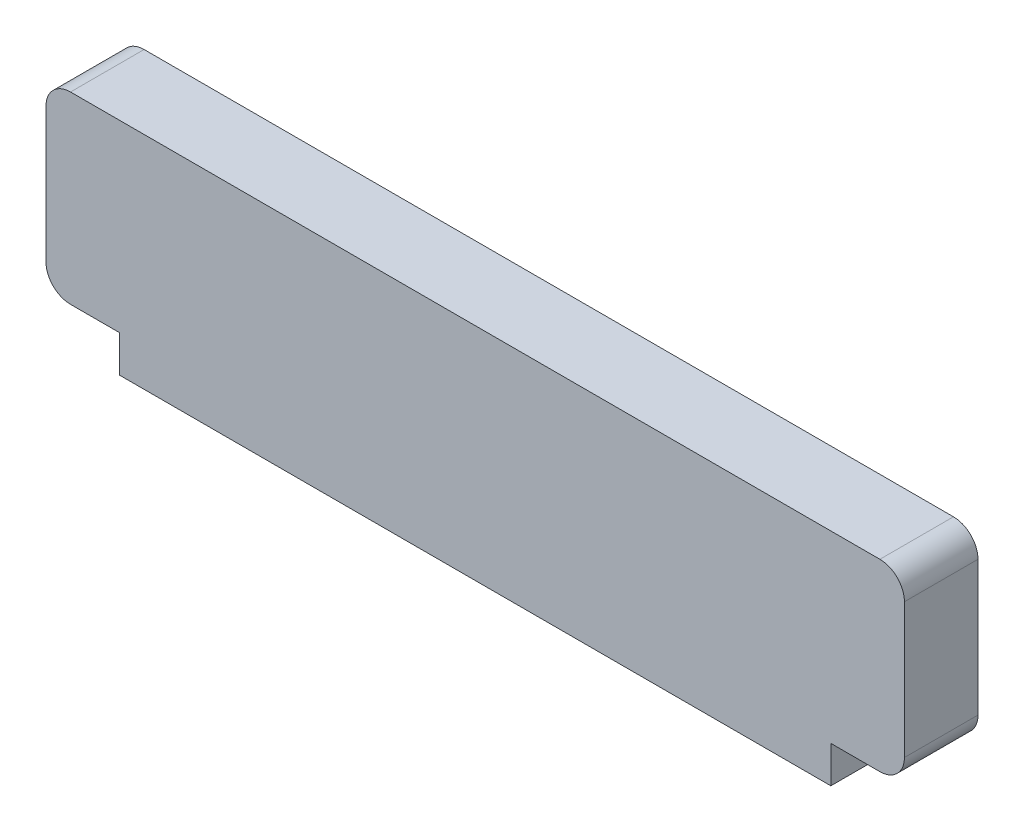
ISO-10303-21;
HEADER;
FILE_DESCRIPTION(('STEP AP214'),'2;1');
FILE_NAME('part.step','',(''),(''),'','','');
FILE_SCHEMA(('AUTOMOTIVE_DESIGN { 1 0 10303 214 1 1 1 1 }'));
ENDSEC;
DATA;
#1=APPLICATION_CONTEXT('core data for automotive mechanical design processes');
#2=APPLICATION_PROTOCOL_DEFINITION('international standard','automotive_design',2000,#1);
#3=PRODUCT_CONTEXT('',#1,'mechanical');
#4=PRODUCT('Part','Part','',(#3));
#5=PRODUCT_RELATED_PRODUCT_CATEGORY('part','',(#4));
#6=PRODUCT_DEFINITION_FORMATION('','',#4);
#7=PRODUCT_DEFINITION_CONTEXT('part definition',#1,'design');
#8=PRODUCT_DEFINITION('design','',#6,#7);
#9=PRODUCT_DEFINITION_SHAPE('','',#8);
#10=(LENGTH_UNIT() NAMED_UNIT(*) SI_UNIT(.MILLI.,.METRE.));
#11=(NAMED_UNIT(*) PLANE_ANGLE_UNIT() SI_UNIT($,.RADIAN.));
#12=(NAMED_UNIT(*) SI_UNIT($,.STERADIAN.) SOLID_ANGLE_UNIT());
#13=UNCERTAINTY_MEASURE_WITH_UNIT(LENGTH_MEASURE(1.E-05),#10,'distance_accuracy_value','');
#14=(GEOMETRIC_REPRESENTATION_CONTEXT(3) GLOBAL_UNCERTAINTY_ASSIGNED_CONTEXT((#13)) GLOBAL_UNIT_ASSIGNED_CONTEXT((#10,
#11,#12)) REPRESENTATION_CONTEXT('',''));
#15=CARTESIAN_POINT('',(0.,0.,0.));
#16=DIRECTION('',(0.,0.,1.));
#17=DIRECTION('',(1.,0.,0.));
#18=AXIS2_PLACEMENT_3D('',#15,#16,#17);
#19=CARTESIAN_POINT('',(0.,0.,6.));
#20=DIRECTION('',(0.,1.,0.));
#21=DIRECTION('',(0.,0.,1.));
#22=AXIS2_PLACEMENT_3D('',#19,#20,#21);
#23=PLANE('',#22);
#24=DIRECTION('',(0.,0.,-1.));
#25=VECTOR('',#24,1.);
#26=CARTESIAN_POINT('',(6.,0.,6.));
#27=LINE('',#26,#25);
#28=CARTESIAN_POINT('',(6.,0.,6.));
#29=VERTEX_POINT('',#28);
#30=CARTESIAN_POINT('',(6.,0.,0.));
#31=VERTEX_POINT('',#30);
#32=EDGE_CURVE('E57',#29,#31,#27,.T.);
#33=ORIENTED_EDGE('',*,*,#32,.F.);
#34=DIRECTION('',(1.,0.,0.));
#35=VECTOR('',#34,1.);
#36=CARTESIAN_POINT('',(0.,0.,6.));
#37=LINE('',#36,#35);
#38=CARTESIAN_POINT('',(2.,0.,6.));
#39=VERTEX_POINT('',#38);
#40=EDGE_CURVE('E162',#39,#29,#37,.T.);
#41=ORIENTED_EDGE('',*,*,#40,.F.);
#42=DIRECTION('',(0.,0.,-1.));
#43=VECTOR('',#42,1.);
#44=CARTESIAN_POINT('',(2.,0.,6.));
#45=LINE('',#44,#43);
#46=CARTESIAN_POINT('',(2.,0.,0.));
#47=VERTEX_POINT('',#46);
#48=EDGE_CURVE('E206',#39,#47,#45,.T.);
#49=ORIENTED_EDGE('',*,*,#48,.T.);
#50=DIRECTION('',(1.,0.,0.));
#51=VECTOR('',#50,1.);
#52=CARTESIAN_POINT('',(0.,0.,0.));
#53=LINE('',#52,#51);
#54=EDGE_CURVE('E171',#47,#31,#53,.T.);
#55=ORIENTED_EDGE('',*,*,#54,.T.);
#56=EDGE_LOOP('',(#33,#41,#49,#55));
#57=FACE_BOUND('',#56,.T.);
#58=ADVANCED_FACE('F34',(#57),#23,.F.);
#59=DIRECTION('',(0.,0.,1.));
#60=VECTOR('',#59,1.);
#61=CARTESIAN_POINT('',(64.,0.,6.));
#62=LINE('',#61,#60);
#63=CARTESIAN_POINT('',(64.,0.,0.));
#64=VERTEX_POINT('',#63);
#65=CARTESIAN_POINT('',(64.,0.,6.));
#66=VERTEX_POINT('',#65);
#67=EDGE_CURVE('E146',#64,#66,#62,.T.);
#68=ORIENTED_EDGE('',*,*,#67,.F.);
#69=CARTESIAN_POINT('',(68.,0.,0.));
#70=VERTEX_POINT('',#69);
#71=EDGE_CURVE('E152',#64,#70,#53,.T.);
#72=ORIENTED_EDGE('',*,*,#71,.T.);
#73=DIRECTION('',(0.,0.,-1.));
#74=VECTOR('',#73,1.);
#75=CARTESIAN_POINT('',(68.,0.,6.));
#76=LINE('',#75,#74);
#77=CARTESIAN_POINT('',(68.,0.,6.));
#78=VERTEX_POINT('',#77);
#79=EDGE_CURVE('E204',#70,#78,#76,.F.);
#80=ORIENTED_EDGE('',*,*,#79,.T.);
#81=EDGE_CURVE('E49',#66,#78,#37,.T.);
#82=ORIENTED_EDGE('',*,*,#81,.F.);
#83=EDGE_LOOP('',(#68,#72,#80,#82));
#84=FACE_BOUND('',#83,.T.);
#85=ADVANCED_FACE('F248',(#84),#23,.F.);
#86=CARTESIAN_POINT('',(0.,0.,6.));
#87=DIRECTION('',(1.,0.,0.));
#88=DIRECTION('',(0.,0.,-1.));
#89=AXIS2_PLACEMENT_3D('',#86,#87,#88);
#90=PLANE('',#89);
#91=DIRECTION('',(0.,-1.,0.));
#92=VECTOR('',#91,1.);
#93=CARTESIAN_POINT('',(0.,0.,6.));
#94=LINE('',#93,#92);
#95=CARTESIAN_POINT('',(0.,13.,6.));
#96=VERTEX_POINT('',#95);
#97=CARTESIAN_POINT('',(0.,2.,6.));
#98=VERTEX_POINT('',#97);
#99=EDGE_CURVE('E158',#96,#98,#94,.T.);
#100=ORIENTED_EDGE('',*,*,#99,.F.);
#101=DIRECTION('',(0.,0.,-1.));
#102=VECTOR('',#101,1.);
#103=CARTESIAN_POINT('',(0.,13.,6.));
#104=LINE('',#103,#102);
#105=CARTESIAN_POINT('',(0.,13.,0.));
#106=VERTEX_POINT('',#105);
#107=EDGE_CURVE('E179',#96,#106,#104,.T.);
#108=ORIENTED_EDGE('',*,*,#107,.T.);
#109=DIRECTION('',(0.,-1.,0.));
#110=VECTOR('',#109,1.);
#111=CARTESIAN_POINT('',(0.,0.,0.));
#112=LINE('',#111,#110);
#113=CARTESIAN_POINT('',(0.,2.,0.));
#114=VERTEX_POINT('',#113);
#115=EDGE_CURVE('E149',#106,#114,#112,.T.);
#116=ORIENTED_EDGE('',*,*,#115,.T.);
#117=DIRECTION('',(0.,0.,-1.));
#118=VECTOR('',#117,1.);
#119=CARTESIAN_POINT('',(0.,2.,6.));
#120=LINE('',#119,#118);
#121=EDGE_CURVE('E169',#114,#98,#120,.F.);
#122=ORIENTED_EDGE('',*,*,#121,.T.);
#123=EDGE_LOOP('',(#100,#108,#116,#122));
#124=FACE_BOUND('',#123,.T.);
#125=ADVANCED_FACE('F231',(#124),#90,.F.);
#126=CARTESIAN_POINT('',(70.,0.,6.));
#127=DIRECTION('',(-1.,0.,0.));
#128=DIRECTION('',(0.,0.,1.));
#129=AXIS2_PLACEMENT_3D('',#126,#127,#128);
#130=PLANE('',#129);
#131=DIRECTION('',(0.,1.,0.));
#132=VECTOR('',#131,1.);
#133=CARTESIAN_POINT('',(70.,0.,6.));
#134=LINE('',#133,#132);
#135=CARTESIAN_POINT('',(70.,2.,6.));
#136=VERTEX_POINT('',#135);
#137=CARTESIAN_POINT('',(70.,13.,6.));
#138=VERTEX_POINT('',#137);
#139=EDGE_CURVE('E164',#136,#138,#134,.T.);
#140=ORIENTED_EDGE('',*,*,#139,.F.);
#141=DIRECTION('',(0.,0.,-1.));
#142=VECTOR('',#141,1.);
#143=CARTESIAN_POINT('',(70.,2.,6.));
#144=LINE('',#143,#142);
#145=CARTESIAN_POINT('',(70.,2.,0.));
#146=VERTEX_POINT('',#145);
#147=EDGE_CURVE('E11',#136,#146,#144,.T.);
#148=ORIENTED_EDGE('',*,*,#147,.T.);
#149=DIRECTION('',(0.,1.,0.));
#150=VECTOR('',#149,1.);
#151=CARTESIAN_POINT('',(70.,0.,0.));
#152=LINE('',#151,#150);
#153=CARTESIAN_POINT('',(70.,13.,0.));
#154=VERTEX_POINT('',#153);
#155=EDGE_CURVE('E173',#146,#154,#152,.T.);
#156=ORIENTED_EDGE('',*,*,#155,.T.);
#157=DIRECTION('',(0.,0.,-1.));
#158=VECTOR('',#157,1.);
#159=CARTESIAN_POINT('',(70.,13.,6.));
#160=LINE('',#159,#158);
#161=EDGE_CURVE('E42',#154,#138,#160,.F.);
#162=ORIENTED_EDGE('',*,*,#161,.T.);
#163=EDGE_LOOP('',(#140,#148,#156,#162));
#164=FACE_BOUND('',#163,.T.);
#165=ADVANCED_FACE('F211',(#164),#130,.F.);
#166=CARTESIAN_POINT('',(0.,15.,6.));
#167=DIRECTION('',(0.,-1.,0.));
#168=DIRECTION('',(0.,0.,-1.));
#169=AXIS2_PLACEMENT_3D('',#166,#167,#168);
#170=PLANE('',#169);
#171=DIRECTION('',(-1.,0.,0.));
#172=VECTOR('',#171,1.);
#173=CARTESIAN_POINT('',(0.,15.,0.));
#174=LINE('',#173,#172);
#175=CARTESIAN_POINT('',(68.,15.,0.));
#176=VERTEX_POINT('',#175);
#177=CARTESIAN_POINT('',(2.,15.,0.));
#178=VERTEX_POINT('',#177);
#179=EDGE_CURVE('E161',#176,#178,#174,.T.);
#180=ORIENTED_EDGE('',*,*,#179,.T.);
#181=DIRECTION('',(0.,0.,-1.));
#182=VECTOR('',#181,1.);
#183=CARTESIAN_POINT('',(2.,15.,6.));
#184=LINE('',#183,#182);
#185=CARTESIAN_POINT('',(2.,15.,6.));
#186=VERTEX_POINT('',#185);
#187=EDGE_CURVE('E194',#178,#186,#184,.F.);
#188=ORIENTED_EDGE('',*,*,#187,.T.);
#189=DIRECTION('',(-1.,0.,0.));
#190=VECTOR('',#189,1.);
#191=CARTESIAN_POINT('',(0.,15.,6.));
#192=LINE('',#191,#190);
#193=CARTESIAN_POINT('',(68.,15.,6.));
#194=VERTEX_POINT('',#193);
#195=EDGE_CURVE('E167',#194,#186,#192,.T.);
#196=ORIENTED_EDGE('',*,*,#195,.F.);
#197=DIRECTION('',(0.,0.,-1.));
#198=VECTOR('',#197,1.);
#199=CARTESIAN_POINT('',(68.,15.,6.));
#200=LINE('',#199,#198);
#201=EDGE_CURVE('E191',#194,#176,#200,.T.);
#202=ORIENTED_EDGE('',*,*,#201,.T.);
#203=EDGE_LOOP('',(#180,#188,#196,#202));
#204=FACE_BOUND('',#203,.T.);
#205=ADVANCED_FACE('F223',(#204),#170,.F.);
#206=CARTESIAN_POINT('',(0.,0.,6.));
#207=DIRECTION('',(0.,0.,-1.));
#208=DIRECTION('',(-1.,0.,0.));
#209=AXIS2_PLACEMENT_3D('',#206,#207,#208);
#210=PLANE('',#209);
#211=ORIENTED_EDGE('',*,*,#195,.T.);
#212=CARTESIAN_POINT('',(2.,13.,6.));
#213=DIRECTION('',(0.,0.,-1.));
#214=DIRECTION('',(-1.,0.,0.));
#215=AXIS2_PLACEMENT_3D('',#212,#213,#214);
#216=CIRCLE('',#215,2.);
#217=EDGE_CURVE('E202',#186,#96,#216,.F.);
#218=ORIENTED_EDGE('',*,*,#217,.T.);
#219=ORIENTED_EDGE('',*,*,#99,.T.);
#220=CARTESIAN_POINT('',(2.,2.,6.));
#221=DIRECTION('',(0.,0.,-1.));
#222=DIRECTION('',(-1.,0.,0.));
#223=AXIS2_PLACEMENT_3D('',#220,#221,#222);
#224=CIRCLE('',#223,2.);
#225=EDGE_CURVE('E200',#98,#39,#224,.F.);
#226=ORIENTED_EDGE('',*,*,#225,.T.);
#227=ORIENTED_EDGE('',*,*,#40,.T.);
#228=DIRECTION('',(0.,1.,0.));
#229=VECTOR('',#228,1.);
#230=CARTESIAN_POINT('',(6.,-3.,6.));
#231=LINE('',#230,#229);
#232=CARTESIAN_POINT('',(6.,-3.,6.));
#233=VERTEX_POINT('',#232);
#234=EDGE_CURVE('E237',#233,#29,#231,.T.);
#235=ORIENTED_EDGE('',*,*,#234,.F.);
#236=DIRECTION('',(-1.,0.,0.));
#237=VECTOR('',#236,1.);
#238=CARTESIAN_POINT('',(6.,-3.,6.));
#239=LINE('',#238,#237);
#240=CARTESIAN_POINT('',(64.,-3.,6.));
#241=VERTEX_POINT('',#240);
#242=EDGE_CURVE('E142',#241,#233,#239,.T.);
#243=ORIENTED_EDGE('',*,*,#242,.F.);
#244=DIRECTION('',(0.,1.,0.));
#245=VECTOR('',#244,1.);
#246=CARTESIAN_POINT('',(64.,-3.,6.));
#247=LINE('',#246,#245);
#248=EDGE_CURVE('E154',#241,#66,#247,.T.);
#249=ORIENTED_EDGE('',*,*,#248,.T.);
#250=ORIENTED_EDGE('',*,*,#81,.T.);
#251=CARTESIAN_POINT('',(68.,2.,6.));
#252=DIRECTION('',(0.,0.,-1.));
#253=DIRECTION('',(-1.,0.,0.));
#254=AXIS2_PLACEMENT_3D('',#251,#252,#253);
#255=CIRCLE('',#254,2.);
#256=EDGE_CURVE('E198',#78,#136,#255,.F.);
#257=ORIENTED_EDGE('',*,*,#256,.T.);
#258=ORIENTED_EDGE('',*,*,#139,.T.);
#259=CARTESIAN_POINT('',(68.,13.,6.));
#260=DIRECTION('',(0.,0.,-1.));
#261=DIRECTION('',(-1.,0.,0.));
#262=AXIS2_PLACEMENT_3D('',#259,#260,#261);
#263=CIRCLE('',#262,2.);
#264=EDGE_CURVE('E196',#138,#194,#263,.F.);
#265=ORIENTED_EDGE('',*,*,#264,.T.);
#266=EDGE_LOOP('',(#211,#218,#219,#226,#227,#235,#243,#249,#250,#257,#258,#265));
#267=FACE_BOUND('',#266,.T.);
#268=ADVANCED_FACE('F217',(#267),#210,.F.);
#269=CARTESIAN_POINT('',(0.,0.,0.));
#270=DIRECTION('',(0.,0.,-1.));
#271=DIRECTION('',(-1.,0.,0.));
#272=AXIS2_PLACEMENT_3D('',#269,#270,#271);
#273=PLANE('',#272);
#274=ORIENTED_EDGE('',*,*,#115,.F.);
#275=CARTESIAN_POINT('',(2.,13.,0.));
#276=DIRECTION('',(0.,0.,-1.));
#277=DIRECTION('',(-1.,0.,0.));
#278=AXIS2_PLACEMENT_3D('',#275,#276,#277);
#279=CIRCLE('',#278,2.);
#280=EDGE_CURVE('E189',#106,#178,#279,.T.);
#281=ORIENTED_EDGE('',*,*,#280,.T.);
#282=ORIENTED_EDGE('',*,*,#179,.F.);
#283=CARTESIAN_POINT('',(68.,13.,0.));
#284=DIRECTION('',(0.,0.,-1.));
#285=DIRECTION('',(-1.,0.,0.));
#286=AXIS2_PLACEMENT_3D('',#283,#284,#285);
#287=CIRCLE('',#286,2.);
#288=EDGE_CURVE('E182',#176,#154,#287,.T.);
#289=ORIENTED_EDGE('',*,*,#288,.T.);
#290=ORIENTED_EDGE('',*,*,#155,.F.);
#291=CARTESIAN_POINT('',(68.,2.,0.));
#292=DIRECTION('',(0.,0.,-1.));
#293=DIRECTION('',(-1.,0.,0.));
#294=AXIS2_PLACEMENT_3D('',#291,#292,#293);
#295=CIRCLE('',#294,2.);
#296=EDGE_CURVE('E184',#146,#70,#295,.T.);
#297=ORIENTED_EDGE('',*,*,#296,.T.);
#298=ORIENTED_EDGE('',*,*,#71,.F.);
#299=DIRECTION('',(0.,1.,0.));
#300=VECTOR('',#299,1.);
#301=CARTESIAN_POINT('',(64.,-3.,0.));
#302=LINE('',#301,#300);
#303=CARTESIAN_POINT('',(64.,-3.,0.));
#304=VERTEX_POINT('',#303);
#305=EDGE_CURVE('E133',#304,#64,#302,.T.);
#306=ORIENTED_EDGE('',*,*,#305,.F.);
#307=DIRECTION('',(1.,0.,0.));
#308=VECTOR('',#307,1.);
#309=CARTESIAN_POINT('',(64.,-3.,0.));
#310=LINE('',#309,#308);
#311=CARTESIAN_POINT('',(6.,-3.,0.));
#312=VERTEX_POINT('',#311);
#313=EDGE_CURVE('E125',#312,#304,#310,.T.);
#314=ORIENTED_EDGE('',*,*,#313,.F.);
#315=DIRECTION('',(0.,1.,0.));
#316=VECTOR('',#315,1.);
#317=CARTESIAN_POINT('',(6.,-3.,0.));
#318=LINE('',#317,#316);
#319=EDGE_CURVE('E131',#312,#31,#318,.T.);
#320=ORIENTED_EDGE('',*,*,#319,.T.);
#321=ORIENTED_EDGE('',*,*,#54,.F.);
#322=CARTESIAN_POINT('',(2.,2.,0.));
#323=DIRECTION('',(0.,0.,-1.));
#324=DIRECTION('',(-1.,0.,0.));
#325=AXIS2_PLACEMENT_3D('',#322,#323,#324);
#326=CIRCLE('',#325,2.);
#327=EDGE_CURVE('E187',#47,#114,#326,.T.);
#328=ORIENTED_EDGE('',*,*,#327,.T.);
#329=EDGE_LOOP('',(#274,#281,#282,#289,#290,#297,#298,#306,#314,#320,#321,#328));
#330=FACE_BOUND('',#329,.T.);
#331=ADVANCED_FACE('F128',(#330),#273,.T.);
#332=CARTESIAN_POINT('',(2.,13.,6.));
#333=DIRECTION('',(0.,0.,-1.));
#334=DIRECTION('',(-1.,0.,0.));
#335=AXIS2_PLACEMENT_3D('',#332,#333,#334);
#336=CYLINDRICAL_SURFACE('',#335,2.);
#337=ORIENTED_EDGE('',*,*,#217,.F.);
#338=ORIENTED_EDGE('',*,*,#187,.F.);
#339=ORIENTED_EDGE('',*,*,#280,.F.);
#340=ORIENTED_EDGE('',*,*,#107,.F.);
#341=EDGE_LOOP('',(#337,#338,#339,#340));
#342=FACE_BOUND('',#341,.T.);
#343=ADVANCED_FACE('F228',(#342),#336,.T.);
#344=CARTESIAN_POINT('',(2.,2.,6.));
#345=DIRECTION('',(0.,0.,-1.));
#346=DIRECTION('',(-1.,0.,0.));
#347=AXIS2_PLACEMENT_3D('',#344,#345,#346);
#348=CYLINDRICAL_SURFACE('',#347,2.);
#349=ORIENTED_EDGE('',*,*,#225,.F.);
#350=ORIENTED_EDGE('',*,*,#121,.F.);
#351=ORIENTED_EDGE('',*,*,#327,.F.);
#352=ORIENTED_EDGE('',*,*,#48,.F.);
#353=EDGE_LOOP('',(#349,#350,#351,#352));
#354=FACE_BOUND('',#353,.T.);
#355=ADVANCED_FACE('F236',(#354),#348,.T.);
#356=CARTESIAN_POINT('',(68.,2.,6.));
#357=DIRECTION('',(0.,0.,-1.));
#358=DIRECTION('',(-1.,0.,0.));
#359=AXIS2_PLACEMENT_3D('',#356,#357,#358);
#360=CYLINDRICAL_SURFACE('',#359,2.);
#361=ORIENTED_EDGE('',*,*,#256,.F.);
#362=ORIENTED_EDGE('',*,*,#79,.F.);
#363=ORIENTED_EDGE('',*,*,#296,.F.);
#364=ORIENTED_EDGE('',*,*,#147,.F.);
#365=EDGE_LOOP('',(#361,#362,#363,#364));
#366=FACE_BOUND('',#365,.T.);
#367=ADVANCED_FACE('F250',(#366),#360,.T.);
#368=CARTESIAN_POINT('',(68.,13.,6.));
#369=DIRECTION('',(0.,0.,-1.));
#370=DIRECTION('',(-1.,0.,0.));
#371=AXIS2_PLACEMENT_3D('',#368,#369,#370);
#372=CYLINDRICAL_SURFACE('',#371,2.);
#373=ORIENTED_EDGE('',*,*,#264,.F.);
#374=ORIENTED_EDGE('',*,*,#161,.F.);
#375=ORIENTED_EDGE('',*,*,#288,.F.);
#376=ORIENTED_EDGE('',*,*,#201,.F.);
#377=EDGE_LOOP('',(#373,#374,#375,#376));
#378=FACE_BOUND('',#377,.T.);
#379=ADVANCED_FACE('F36',(#378),#372,.T.);
#380=CARTESIAN_POINT('',(6.,-3.,6.));
#381=DIRECTION('',(1.,0.,0.));
#382=DIRECTION('',(0.,0.,-1.));
#383=AXIS2_PLACEMENT_3D('',#380,#381,#382);
#384=PLANE('',#383);
#385=ORIENTED_EDGE('',*,*,#32,.T.);
#386=ORIENTED_EDGE('',*,*,#319,.F.);
#387=DIRECTION('',(0.,0.,-1.));
#388=VECTOR('',#387,1.);
#389=CARTESIAN_POINT('',(6.,-3.,6.));
#390=LINE('',#389,#388);
#391=EDGE_CURVE('E137',#233,#312,#390,.T.);
#392=ORIENTED_EDGE('',*,*,#391,.F.);
#393=ORIENTED_EDGE('',*,*,#234,.T.);
#394=EDGE_LOOP('',(#385,#386,#392,#393));
#395=FACE_BOUND('',#394,.T.);
#396=ADVANCED_FACE('F148',(#395),#384,.F.);
#397=CARTESIAN_POINT('',(64.,-3.,6.));
#398=DIRECTION('',(-1.,0.,0.));
#399=DIRECTION('',(0.,0.,1.));
#400=AXIS2_PLACEMENT_3D('',#397,#398,#399);
#401=PLANE('',#400);
#402=ORIENTED_EDGE('',*,*,#67,.T.);
#403=ORIENTED_EDGE('',*,*,#248,.F.);
#404=DIRECTION('',(0.,0.,1.));
#405=VECTOR('',#404,1.);
#406=CARTESIAN_POINT('',(64.,-3.,6.));
#407=LINE('',#406,#405);
#408=EDGE_CURVE('E136',#304,#241,#407,.T.);
#409=ORIENTED_EDGE('',*,*,#408,.F.);
#410=ORIENTED_EDGE('',*,*,#305,.T.);
#411=EDGE_LOOP('',(#402,#403,#409,#410));
#412=FACE_BOUND('',#411,.T.);
#413=ADVANCED_FACE('F246',(#412),#401,.F.);
#414=CARTESIAN_POINT('',(0.,-3.,0.));
#415=DIRECTION('',(0.,1.,0.));
#416=DIRECTION('',(0.,0.,1.));
#417=AXIS2_PLACEMENT_3D('',#414,#415,#416);
#418=PLANE('',#417);
#419=ORIENTED_EDGE('',*,*,#391,.T.);
#420=ORIENTED_EDGE('',*,*,#313,.T.);
#421=ORIENTED_EDGE('',*,*,#408,.T.);
#422=ORIENTED_EDGE('',*,*,#242,.T.);
#423=EDGE_LOOP('',(#419,#420,#421,#422));
#424=FACE_BOUND('',#423,.T.);
#425=ADVANCED_FACE('F140',(#424),#418,.F.);
#426=CLOSED_SHELL('',(#58,#85,#125,#165,#205,#268,#331,#343,#355,#367,#379,#396,#413,#425));
#427=MANIFOLD_SOLID_BREP('B2',#426);
#428=ADVANCED_BREP_SHAPE_REPRESENTATION('',(#18,#427),#14);
#429=SHAPE_DEFINITION_REPRESENTATION(#9,#428);
ENDSEC;
END-ISO-10303-21;
